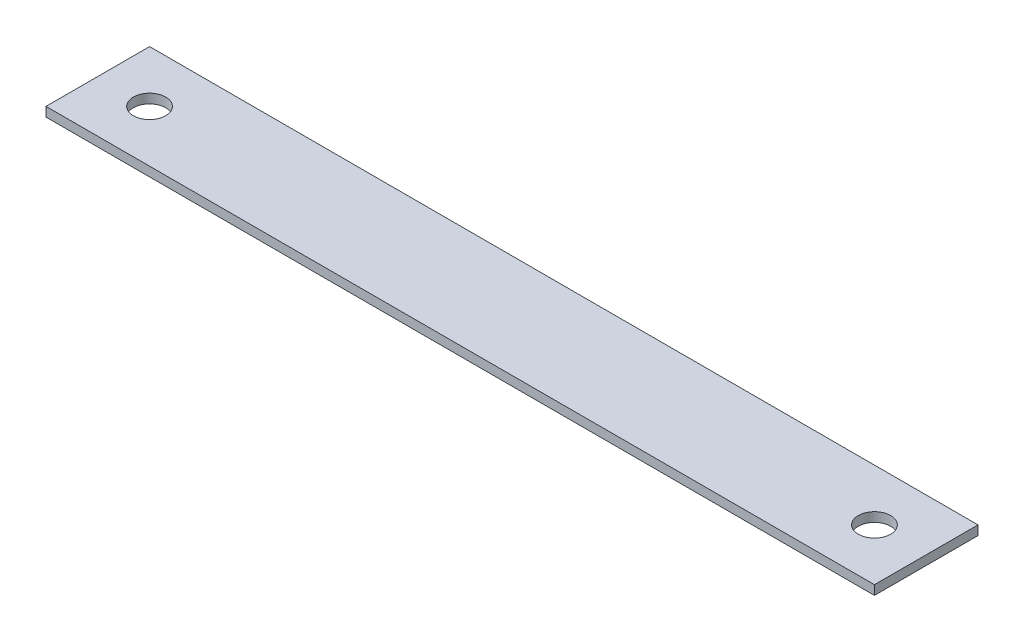
ISO-10303-21;
HEADER;
FILE_DESCRIPTION(('STEP AP214'),'2;1');
FILE_NAME('part.step','',(''),(''),'','','');
FILE_SCHEMA(('AUTOMOTIVE_DESIGN { 1 0 10303 214 1 1 1 1 }'));
ENDSEC;
DATA;
#1=APPLICATION_CONTEXT('core data for automotive mechanical design processes');
#2=APPLICATION_PROTOCOL_DEFINITION('international standard','automotive_design',2000,#1);
#3=PRODUCT_CONTEXT('',#1,'mechanical');
#4=PRODUCT('Part','Part','',(#3));
#5=PRODUCT_RELATED_PRODUCT_CATEGORY('part','',(#4));
#6=PRODUCT_DEFINITION_FORMATION('','',#4);
#7=PRODUCT_DEFINITION_CONTEXT('part definition',#1,'design');
#8=PRODUCT_DEFINITION('design','',#6,#7);
#9=PRODUCT_DEFINITION_SHAPE('','',#8);
#10=(LENGTH_UNIT() NAMED_UNIT(*) SI_UNIT(.MILLI.,.METRE.));
#11=(NAMED_UNIT(*) PLANE_ANGLE_UNIT() SI_UNIT($,.RADIAN.));
#12=(NAMED_UNIT(*) SI_UNIT($,.STERADIAN.) SOLID_ANGLE_UNIT());
#13=UNCERTAINTY_MEASURE_WITH_UNIT(LENGTH_MEASURE(1.E-05),#10,'distance_accuracy_value','');
#14=(GEOMETRIC_REPRESENTATION_CONTEXT(3) GLOBAL_UNCERTAINTY_ASSIGNED_CONTEXT((#13)) GLOBAL_UNIT_ASSIGNED_CONTEXT((#10,
#11,#12)) REPRESENTATION_CONTEXT('',''));
#15=CARTESIAN_POINT('',(0.,0.,0.));
#16=DIRECTION('',(0.,0.,1.));
#17=DIRECTION('',(1.,0.,0.));
#18=AXIS2_PLACEMENT_3D('',#15,#16,#17);
#19=CARTESIAN_POINT('',(0.,2.286,0.));
#20=DIRECTION('',(1.,0.,0.));
#21=DIRECTION('',(0.,0.,-1.));
#22=AXIS2_PLACEMENT_3D('',#19,#20,#21);
#23=PLANE('',#22);
#24=DIRECTION('',(0.,0.,1.));
#25=VECTOR('',#24,1.);
#26=CARTESIAN_POINT('',(0.,0.,0.));
#27=LINE('',#26,#25);
#28=CARTESIAN_POINT('',(0.,0.,-25.4));
#29=VERTEX_POINT('',#28);
#30=CARTESIAN_POINT('',(0.,0.,0.));
#31=VERTEX_POINT('',#30);
#32=EDGE_CURVE('E107',#29,#31,#27,.T.);
#33=ORIENTED_EDGE('',*,*,#32,.T.);
#34=DIRECTION('',(0.,-1.,0.));
#35=VECTOR('',#34,1.);
#36=CARTESIAN_POINT('',(0.,2.286,0.));
#37=LINE('',#36,#35);
#38=CARTESIAN_POINT('',(0.,2.286,0.));
#39=VERTEX_POINT('',#38);
#40=EDGE_CURVE('E11',#39,#31,#37,.T.);
#41=ORIENTED_EDGE('',*,*,#40,.F.);
#42=DIRECTION('',(0.,0.,1.));
#43=VECTOR('',#42,1.);
#44=CARTESIAN_POINT('',(0.,2.286,0.));
#45=LINE('',#44,#43);
#46=CARTESIAN_POINT('',(0.,2.286,-25.4));
#47=VERTEX_POINT('',#46);
#48=EDGE_CURVE('E91',#47,#39,#45,.T.);
#49=ORIENTED_EDGE('',*,*,#48,.F.);
#50=DIRECTION('',(0.,-1.,0.));
#51=VECTOR('',#50,1.);
#52=CARTESIAN_POINT('',(0.,2.286,-25.4));
#53=LINE('',#52,#51);
#54=EDGE_CURVE('E103',#47,#29,#53,.T.);
#55=ORIENTED_EDGE('',*,*,#54,.T.);
#56=EDGE_LOOP('',(#33,#41,#49,#55));
#57=FACE_BOUND('',#56,.T.);
#58=ADVANCED_FACE('F39',(#57),#23,.F.);
#59=CARTESIAN_POINT('',(0.,2.286,0.));
#60=DIRECTION('',(0.,0.,-1.));
#61=DIRECTION('',(-1.,0.,0.));
#62=AXIS2_PLACEMENT_3D('',#59,#60,#61);
#63=PLANE('',#62);
#64=DIRECTION('',(1.,0.,0.));
#65=VECTOR('',#64,1.);
#66=CARTESIAN_POINT('',(0.,0.,0.));
#67=LINE('',#66,#65);
#68=CARTESIAN_POINT('',(203.2,0.,0.));
#69=VERTEX_POINT('',#68);
#70=EDGE_CURVE('E96',#31,#69,#67,.T.);
#71=ORIENTED_EDGE('',*,*,#70,.T.);
#72=DIRECTION('',(0.,-1.,0.));
#73=VECTOR('',#72,1.);
#74=CARTESIAN_POINT('',(203.2,2.286,0.));
#75=LINE('',#74,#73);
#76=CARTESIAN_POINT('',(203.2,2.286,0.));
#77=VERTEX_POINT('',#76);
#78=EDGE_CURVE('E48',#77,#69,#75,.T.);
#79=ORIENTED_EDGE('',*,*,#78,.F.);
#80=DIRECTION('',(1.,0.,0.));
#81=VECTOR('',#80,1.);
#82=CARTESIAN_POINT('',(0.,2.286,0.));
#83=LINE('',#82,#81);
#84=EDGE_CURVE('E86',#39,#77,#83,.T.);
#85=ORIENTED_EDGE('',*,*,#84,.F.);
#86=ORIENTED_EDGE('',*,*,#40,.T.);
#87=EDGE_LOOP('',(#71,#79,#85,#86));
#88=FACE_BOUND('',#87,.T.);
#89=ADVANCED_FACE('F95',(#88),#63,.F.);
#90=CARTESIAN_POINT('',(203.2,2.286,0.));
#91=DIRECTION('',(-1.,0.,0.));
#92=DIRECTION('',(0.,0.,1.));
#93=AXIS2_PLACEMENT_3D('',#90,#91,#92);
#94=PLANE('',#93);
#95=DIRECTION('',(0.,0.,-1.));
#96=VECTOR('',#95,1.);
#97=CARTESIAN_POINT('',(203.2,0.,0.));
#98=LINE('',#97,#96);
#99=CARTESIAN_POINT('',(203.2,0.,-25.4));
#100=VERTEX_POINT('',#99);
#101=EDGE_CURVE('E73',#69,#100,#98,.T.);
#102=ORIENTED_EDGE('',*,*,#101,.T.);
#103=DIRECTION('',(0.,-1.,0.));
#104=VECTOR('',#103,1.);
#105=CARTESIAN_POINT('',(203.2,2.286,-25.4));
#106=LINE('',#105,#104);
#107=CARTESIAN_POINT('',(203.2,2.286,-25.4));
#108=VERTEX_POINT('',#107);
#109=EDGE_CURVE('E98',#108,#100,#106,.T.);
#110=ORIENTED_EDGE('',*,*,#109,.F.);
#111=DIRECTION('',(0.,0.,-1.));
#112=VECTOR('',#111,1.);
#113=CARTESIAN_POINT('',(203.2,2.286,0.));
#114=LINE('',#113,#112);
#115=EDGE_CURVE('E89',#77,#108,#114,.T.);
#116=ORIENTED_EDGE('',*,*,#115,.F.);
#117=ORIENTED_EDGE('',*,*,#78,.T.);
#118=EDGE_LOOP('',(#102,#110,#116,#117));
#119=FACE_BOUND('',#118,.T.);
#120=ADVANCED_FACE('F99',(#119),#94,.F.);
#121=CARTESIAN_POINT('',(0.,2.286,-25.4));
#122=DIRECTION('',(0.,0.,1.));
#123=DIRECTION('',(1.,0.,0.));
#124=AXIS2_PLACEMENT_3D('',#121,#122,#123);
#125=PLANE('',#124);
#126=DIRECTION('',(-1.,0.,0.));
#127=VECTOR('',#126,1.);
#128=CARTESIAN_POINT('',(0.,0.,-25.4));
#129=LINE('',#128,#127);
#130=EDGE_CURVE('E79',#100,#29,#129,.T.);
#131=ORIENTED_EDGE('',*,*,#130,.T.);
#132=ORIENTED_EDGE('',*,*,#54,.F.);
#133=DIRECTION('',(-1.,0.,0.));
#134=VECTOR('',#133,1.);
#135=CARTESIAN_POINT('',(0.,2.286,-25.4));
#136=LINE('',#135,#134);
#137=EDGE_CURVE('E56',#108,#47,#136,.T.);
#138=ORIENTED_EDGE('',*,*,#137,.F.);
#139=ORIENTED_EDGE('',*,*,#109,.T.);
#140=EDGE_LOOP('',(#131,#132,#138,#139));
#141=FACE_BOUND('',#140,.T.);
#142=ADVANCED_FACE('F121',(#141),#125,.F.);
#143=CARTESIAN_POINT('',(0.,2.286,0.));
#144=DIRECTION('',(0.,-1.,0.));
#145=DIRECTION('',(0.,0.,-1.));
#146=AXIS2_PLACEMENT_3D('',#143,#144,#145);
#147=PLANE('',#146);
#148=CARTESIAN_POINT('',(12.7,2.286,-12.7));
#149=DIRECTION('',(0.,1.,0.));
#150=DIRECTION('',(0.,0.,1.));
#151=AXIS2_PLACEMENT_3D('',#148,#149,#150);
#152=CIRCLE('',#151,3.96875);
#153=CARTESIAN_POINT('',(12.7,2.286,-8.73125));
#154=VERTEX_POINT('',#153);
#155=EDGE_CURVE('E136',#154,#154,#152,.T.);
#156=ORIENTED_EDGE('',*,*,#155,.F.);
#157=EDGE_LOOP('',(#156));
#158=FACE_BOUND('',#157,.T.);
#159=CARTESIAN_POINT('',(190.5,2.286,-12.7));
#160=DIRECTION('',(0.,1.,0.));
#161=DIRECTION('',(0.,0.,1.));
#162=AXIS2_PLACEMENT_3D('',#159,#160,#161);
#163=CIRCLE('',#162,3.96874999999999);
#164=CARTESIAN_POINT('',(190.5,2.286,-8.73125000000001));
#165=VERTEX_POINT('',#164);
#166=EDGE_CURVE('E128',#165,#165,#163,.T.);
#167=ORIENTED_EDGE('',*,*,#166,.F.);
#168=EDGE_LOOP('',(#167));
#169=FACE_BOUND('',#168,.T.);
#170=ORIENTED_EDGE('',*,*,#48,.T.);
#171=ORIENTED_EDGE('',*,*,#84,.T.);
#172=ORIENTED_EDGE('',*,*,#115,.T.);
#173=ORIENTED_EDGE('',*,*,#137,.T.);
#174=EDGE_LOOP('',(#170,#171,#172,#173));
#175=FACE_BOUND('',#174,.T.);
#176=ADVANCED_FACE('F87',(#158,#169,#175),#147,.F.);
#177=CARTESIAN_POINT('',(0.,0.,0.));
#178=DIRECTION('',(0.,-1.,0.));
#179=DIRECTION('',(0.,0.,-1.));
#180=AXIS2_PLACEMENT_3D('',#177,#178,#179);
#181=PLANE('',#180);
#182=CARTESIAN_POINT('',(12.7,0.,-12.7));
#183=DIRECTION('',(0.,1.,0.));
#184=DIRECTION('',(0.,0.,1.));
#185=AXIS2_PLACEMENT_3D('',#182,#183,#184);
#186=CIRCLE('',#185,3.96875);
#187=CARTESIAN_POINT('',(12.7,0.,-8.73125));
#188=VERTEX_POINT('',#187);
#189=EDGE_CURVE('E111',#188,#188,#186,.T.);
#190=ORIENTED_EDGE('',*,*,#189,.T.);
#191=EDGE_LOOP('',(#190));
#192=FACE_BOUND('',#191,.T.);
#193=CARTESIAN_POINT('',(190.5,0.,-12.7));
#194=DIRECTION('',(0.,1.,0.));
#195=DIRECTION('',(0.,0.,1.));
#196=AXIS2_PLACEMENT_3D('',#193,#194,#195);
#197=CIRCLE('',#196,3.96874999999999);
#198=CARTESIAN_POINT('',(190.5,0.,-8.73125000000001));
#199=VERTEX_POINT('',#198);
#200=EDGE_CURVE('E132',#199,#199,#197,.T.);
#201=ORIENTED_EDGE('',*,*,#200,.T.);
#202=EDGE_LOOP('',(#201));
#203=FACE_BOUND('',#202,.T.);
#204=ORIENTED_EDGE('',*,*,#32,.F.);
#205=ORIENTED_EDGE('',*,*,#130,.F.);
#206=ORIENTED_EDGE('',*,*,#101,.F.);
#207=ORIENTED_EDGE('',*,*,#70,.F.);
#208=EDGE_LOOP('',(#204,#205,#206,#207));
#209=FACE_BOUND('',#208,.T.);
#210=ADVANCED_FACE('F124',(#192,#203,#209),#181,.T.);
#211=CARTESIAN_POINT('',(190.5,0.,-12.7));
#212=DIRECTION('',(0.,1.,0.));
#213=DIRECTION('',(0.,0.,1.));
#214=AXIS2_PLACEMENT_3D('',#211,#212,#213);
#215=CYLINDRICAL_SURFACE('',#214,3.96874999999999);
#216=ORIENTED_EDGE('',*,*,#200,.F.);
#217=EDGE_LOOP('',(#216));
#218=FACE_BOUND('',#217,.T.);
#219=ORIENTED_EDGE('',*,*,#166,.T.);
#220=EDGE_LOOP('',(#219));
#221=FACE_BOUND('',#220,.T.);
#222=ADVANCED_FACE('F149',(#218,#221),#215,.F.);
#223=CARTESIAN_POINT('',(12.7,0.,-12.7));
#224=DIRECTION('',(0.,1.,0.));
#225=DIRECTION('',(0.,0.,1.));
#226=AXIS2_PLACEMENT_3D('',#223,#224,#225);
#227=CYLINDRICAL_SURFACE('',#226,3.96875);
#228=ORIENTED_EDGE('',*,*,#189,.F.);
#229=EDGE_LOOP('',(#228));
#230=FACE_BOUND('',#229,.T.);
#231=ORIENTED_EDGE('',*,*,#155,.T.);
#232=EDGE_LOOP('',(#231));
#233=FACE_BOUND('',#232,.T.);
#234=ADVANCED_FACE('F146',(#230,#233),#227,.F.);
#235=CLOSED_SHELL('',(#58,#89,#120,#142,#176,#210,#222,#234));
#236=MANIFOLD_SOLID_BREP('B2',#235);
#237=ADVANCED_BREP_SHAPE_REPRESENTATION('',(#18,#236),#14);
#238=SHAPE_DEFINITION_REPRESENTATION(#9,#237);
ENDSEC;
END-ISO-10303-21;
